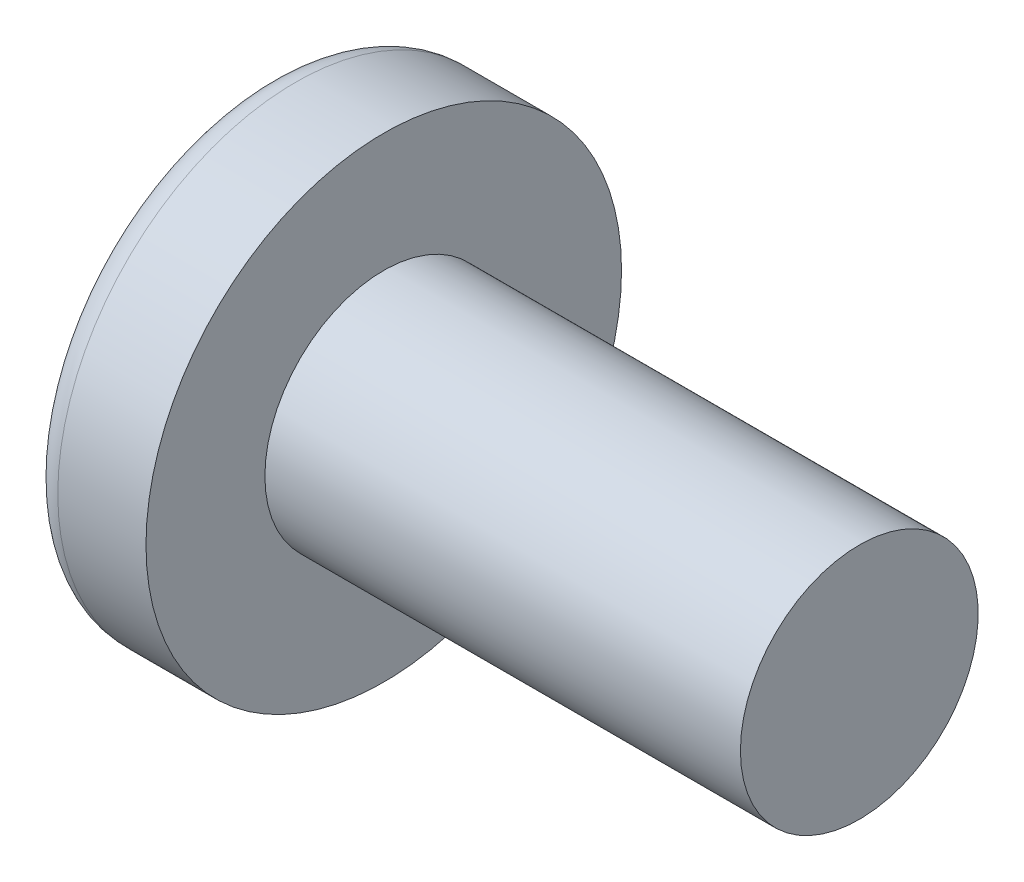
ISO-10303-21;
HEADER;
FILE_DESCRIPTION(('STEP AP214'),'2;1');
FILE_NAME('part.step','',(''),(''),'','','');
FILE_SCHEMA(('AUTOMOTIVE_DESIGN { 1 0 10303 214 1 1 1 1 }'));
ENDSEC;
DATA;
#1=APPLICATION_CONTEXT('core data for automotive mechanical design processes');
#2=APPLICATION_PROTOCOL_DEFINITION('international standard','automotive_design',2000,#1);
#3=PRODUCT_CONTEXT('',#1,'mechanical');
#4=PRODUCT('Part','Part','',(#3));
#5=PRODUCT_RELATED_PRODUCT_CATEGORY('part','',(#4));
#6=PRODUCT_DEFINITION_FORMATION('','',#4);
#7=PRODUCT_DEFINITION_CONTEXT('part definition',#1,'design');
#8=PRODUCT_DEFINITION('design','',#6,#7);
#9=PRODUCT_DEFINITION_SHAPE('','',#8);
#10=(LENGTH_UNIT() NAMED_UNIT(*) SI_UNIT(.MILLI.,.METRE.));
#11=(NAMED_UNIT(*) PLANE_ANGLE_UNIT() SI_UNIT($,.RADIAN.));
#12=(NAMED_UNIT(*) SI_UNIT($,.STERADIAN.) SOLID_ANGLE_UNIT());
#13=UNCERTAINTY_MEASURE_WITH_UNIT(LENGTH_MEASURE(1.E-05),#10,'distance_accuracy_value','');
#14=(GEOMETRIC_REPRESENTATION_CONTEXT(3) GLOBAL_UNCERTAINTY_ASSIGNED_CONTEXT((#13)) GLOBAL_UNIT_ASSIGNED_CONTEXT((#10,
#11,#12)) REPRESENTATION_CONTEXT('',''));
#15=CARTESIAN_POINT('',(0.,0.,0.));
#16=DIRECTION('',(0.,0.,1.));
#17=DIRECTION('',(1.,0.,0.));
#18=AXIS2_PLACEMENT_3D('',#15,#16,#17);
#19=CARTESIAN_POINT('',(6.5,0.,0.));
#20=DIRECTION('',(-1.,0.,0.));
#21=DIRECTION('',(0.,1.,0.));
#22=AXIS2_PLACEMENT_3D('',#19,#20,#21);
#23=SPHERICAL_SURFACE('',#22,6.5);
#24=CARTESIAN_POINT('',(1.22696010591455,0.,0.));
#25=DIRECTION('',(-1.,0.,0.));
#26=DIRECTION('',(0.,0.,1.));
#27=AXIS2_PLACEMENT_3D('',#24,#25,#26);
#28=CIRCLE('',#27,3.80066445182724);
#29=CARTESIAN_POINT('',(1.22696010591455,0.,3.80066445182724));
#30=VERTEX_POINT('',#29);
#31=EDGE_CURVE('E155',#30,#30,#28,.T.);
#32=ORIENTED_EDGE('',*,*,#31,.T.);
#33=EDGE_LOOP('',(#32));
#34=FACE_BOUND('',#33,.T.);
#35=CARTESIAN_POINT('',(6.48571960757402,-0.15048155459631,0.));
#36=DIRECTION('',(-0.0944735162161081,-0.995527375180494,0.));
#37=DIRECTION('',(0.995527375180494,-0.0944735162161081,0.));
#38=AXIS2_PLACEMENT_3D('',#35,#36,#37);
#39=CIRCLE('',#38,6.49824217555167);
#40=CARTESIAN_POINT('',(0.314004666074211,0.4352015980154,1.94783502836694));
#41=VERTEX_POINT('',#40);
#42=CARTESIAN_POINT('',(0.0329034112486436,0.461877533422321,0.461877533422323));
#43=VERTEX_POINT('',#42);
#44=EDGE_CURVE('E186',#41,#43,#39,.T.);
#45=ORIENTED_EDGE('',*,*,#44,.F.);
#46=CARTESIAN_POINT('',(5.02565375064329,0.,-1.83590765485334));
#47=DIRECTION('',(0.626149356629992,0.,0.779703137861998));
#48=DIRECTION('',(0.779703137861998,0.,-0.626149356629992));
#49=AXIS2_PLACEMENT_3D('',#46,#47,#48);
#50=CIRCLE('',#49,6.05852673674539);
#51=CARTESIAN_POINT('',(0.314004666074211,-0.435201598015413,1.94783502836693));
#52=VERTEX_POINT('',#51);
#53=EDGE_CURVE('E151',#41,#52,#50,.T.);
#54=ORIENTED_EDGE('',*,*,#53,.T.);
#55=CARTESIAN_POINT('',(6.48571960757402,0.15048155459631,0.));
#56=DIRECTION('',(-0.0944735162161081,0.995527375180494,0.));
#57=DIRECTION('',(-0.995527375180494,-0.0944735162161081,0.));
#58=AXIS2_PLACEMENT_3D('',#55,#56,#57);
#59=CIRCLE('',#58,6.49824217555167);
#60=CARTESIAN_POINT('',(0.0329034112486436,-0.461877533422324,0.461877533422323));
#61=VERTEX_POINT('',#60);
#62=EDGE_CURVE('E107',#61,#52,#59,.T.);
#63=ORIENTED_EDGE('',*,*,#62,.F.);
#64=CARTESIAN_POINT('',(6.48571960757402,0.,-0.15048155459631));
#65=DIRECTION('',(-0.0944735162161081,0.,-0.995527375180494));
#66=DIRECTION('',(-0.995527375180494,0.,0.0944735162161081));
#67=AXIS2_PLACEMENT_3D('',#64,#65,#66);
#68=CIRCLE('',#67,6.49824217555167);
#69=CARTESIAN_POINT('',(0.31400466607421,-1.94783502836693,0.435201598015406));
#70=VERTEX_POINT('',#69);
#71=EDGE_CURVE('E132',#70,#61,#68,.T.);
#72=ORIENTED_EDGE('',*,*,#71,.F.);
#73=CARTESIAN_POINT('',(5.02565375064329,1.83590765485334,0.));
#74=DIRECTION('',(0.626149356629992,-0.779703137861998,0.));
#75=DIRECTION('',(0.779703137861998,0.626149356629992,0.));
#76=AXIS2_PLACEMENT_3D('',#73,#74,#75);
#77=CIRCLE('',#76,6.05852673674539);
#78=CARTESIAN_POINT('',(0.31400466607421,-1.94783502836693,-0.435201598015407));
#79=VERTEX_POINT('',#78);
#80=EDGE_CURVE('E140',#70,#79,#77,.T.);
#81=ORIENTED_EDGE('',*,*,#80,.T.);
#82=CARTESIAN_POINT('',(6.48571960757402,0.,0.15048155459631));
#83=DIRECTION('',(-0.0944735162161081,0.,0.995527375180494));
#84=DIRECTION('',(0.995527375180494,0.,0.0944735162161081));
#85=AXIS2_PLACEMENT_3D('',#82,#83,#84);
#86=CIRCLE('',#85,6.49824217555167);
#87=CARTESIAN_POINT('',(0.0329034112486436,-0.461877533422321,-0.461877533422323));
#88=VERTEX_POINT('',#87);
#89=EDGE_CURVE('E50',#88,#79,#86,.T.);
#90=ORIENTED_EDGE('',*,*,#89,.F.);
#91=CARTESIAN_POINT('',(0.314004666074211,-0.435201598015399,-1.94783502836694));
#92=VERTEX_POINT('',#91);
#93=EDGE_CURVE('E193',#92,#88,#59,.T.);
#94=ORIENTED_EDGE('',*,*,#93,.F.);
#95=CARTESIAN_POINT('',(5.02565375064329,0.,1.83590765485334));
#96=DIRECTION('',(0.626149356629992,0.,-0.779703137861998));
#97=DIRECTION('',(-0.779703137861998,0.,-0.626149356629992));
#98=AXIS2_PLACEMENT_3D('',#95,#96,#97);
#99=CIRCLE('',#98,6.05852673674539);
#100=CARTESIAN_POINT('',(0.314004666074212,0.435201598015413,-1.94783502836693));
#101=VERTEX_POINT('',#100);
#102=EDGE_CURVE('E133',#92,#101,#99,.T.);
#103=ORIENTED_EDGE('',*,*,#102,.T.);
#104=CARTESIAN_POINT('',(0.0329034112486436,0.461877533422324,-0.461877533422323));
#105=VERTEX_POINT('',#104);
#106=EDGE_CURVE('E181',#105,#101,#39,.T.);
#107=ORIENTED_EDGE('',*,*,#106,.F.);
#108=CARTESIAN_POINT('',(0.314004666074212,1.94783502836693,-0.435201598015406));
#109=VERTEX_POINT('',#108);
#110=EDGE_CURVE('E43',#109,#105,#86,.T.);
#111=ORIENTED_EDGE('',*,*,#110,.F.);
#112=CARTESIAN_POINT('',(5.02565375064329,-1.83590765485334,0.));
#113=DIRECTION('',(0.626149356629992,0.779703137861998,0.));
#114=DIRECTION('',(-0.779703137861998,0.626149356629992,0.));
#115=AXIS2_PLACEMENT_3D('',#112,#113,#114);
#116=CIRCLE('',#115,6.05852673674539);
#117=CARTESIAN_POINT('',(0.314004666074212,1.94783502836693,0.435201598015407));
#118=VERTEX_POINT('',#117);
#119=EDGE_CURVE('E11',#109,#118,#116,.T.);
#120=ORIENTED_EDGE('',*,*,#119,.T.);
#121=EDGE_CURVE('E169',#43,#118,#68,.T.);
#122=ORIENTED_EDGE('',*,*,#121,.F.);
#123=EDGE_LOOP('',(#45,#54,#63,#72,#81,#90,#94,#103,#107,#111,#120,#122));
#124=FACE_BOUND('',#123,.T.);
#125=ADVANCED_FACE('F35',(#34,#124),#23,.T.);
#126=CARTESIAN_POINT('',(2.73951715374841,0.,-0.20502541296061));
#127=DIRECTION('',(-0.0944735162161081,0.,0.995527375180494));
#128=DIRECTION('',(0.995527375180494,0.,0.0944735162161081));
#129=AXIS2_PLACEMENT_3D('',#126,#127,#128);
#130=PLANE('',#129);
#131=ORIENTED_EDGE('',*,*,#110,.T.);
#132=DIRECTION('',(0.991114231601325,-0.0940547178968607,0.0940547178968604));
#133=VECTOR('',#132,1.);
#134=CARTESIAN_POINT('',(2.75862941145706,0.203211698708667,-0.203211698708667));
#135=LINE('',#134,#133);
#136=CARTESIAN_POINT('',(2.45,0.232500000000001,-0.232499999999999));
#137=VERTEX_POINT('',#136);
#138=EDGE_CURVE('E175',#105,#137,#135,.T.);
#139=ORIENTED_EDGE('',*,*,#138,.T.);
#140=DIRECTION('',(0.777577482844895,-0.624442325509115,0.0737905162291584));
#141=VECTOR('',#140,1.);
#142=CARTESIAN_POINT('',(0.,2.2,-0.465));
#143=LINE('',#142,#141);
#144=EDGE_CURVE('E156',#109,#137,#143,.T.);
#145=ORIENTED_EDGE('',*,*,#144,.F.);
#146=EDGE_LOOP('',(#131,#139,#145));
#147=FACE_BOUND('',#146,.T.);
#148=ADVANCED_FACE('F174',(#147),#130,.T.);
#149=DIRECTION('',(0.777577482844895,0.624442325509115,0.0737905162291584));
#150=VECTOR('',#149,1.);
#151=CARTESIAN_POINT('',(0.,-2.2,-0.465));
#152=LINE('',#151,#150);
#153=CARTESIAN_POINT('',(2.45,-0.2325,-0.2325));
#154=VERTEX_POINT('',#153);
#155=EDGE_CURVE('E141',#79,#154,#152,.T.);
#156=ORIENTED_EDGE('',*,*,#155,.T.);
#157=DIRECTION('',(-0.991114231601325,-0.09405471789686,-0.0940547178968604));
#158=VECTOR('',#157,1.);
#159=CARTESIAN_POINT('',(2.75862941145706,-0.203211698708666,-0.203211698708667));
#160=LINE('',#159,#158);
#161=EDGE_CURVE('E196',#154,#88,#160,.T.);
#162=ORIENTED_EDGE('',*,*,#161,.T.);
#163=ORIENTED_EDGE('',*,*,#89,.T.);
#164=EDGE_LOOP('',(#156,#162,#163));
#165=FACE_BOUND('',#164,.T.);
#166=ADVANCED_FACE('F211',(#165),#130,.T.);
#167=CARTESIAN_POINT('',(2.73951715374841,0.,0.20502541296061));
#168=DIRECTION('',(-0.0944735162161081,0.,-0.995527375180494));
#169=DIRECTION('',(-0.995527375180494,0.,0.0944735162161081));
#170=AXIS2_PLACEMENT_3D('',#167,#168,#169);
#171=PLANE('',#170);
#172=DIRECTION('',(0.777577482844895,-0.624442325509115,-0.0737905162291585));
#173=VECTOR('',#172,1.);
#174=CARTESIAN_POINT('',(0.,2.2,0.465));
#175=LINE('',#174,#173);
#176=CARTESIAN_POINT('',(2.45,0.2325,0.2325));
#177=VERTEX_POINT('',#176);
#178=EDGE_CURVE('E212',#118,#177,#175,.T.);
#179=ORIENTED_EDGE('',*,*,#178,.T.);
#180=DIRECTION('',(-0.991114231601325,0.0940547178968601,0.0940547178968604));
#181=VECTOR('',#180,1.);
#182=CARTESIAN_POINT('',(2.75862941145706,0.203211698708666,0.203211698708667));
#183=LINE('',#182,#181);
#184=EDGE_CURVE('E190',#177,#43,#183,.T.);
#185=ORIENTED_EDGE('',*,*,#184,.T.);
#186=ORIENTED_EDGE('',*,*,#121,.T.);
#187=EDGE_LOOP('',(#179,#185,#186));
#188=FACE_BOUND('',#187,.T.);
#189=ADVANCED_FACE('F216',(#188),#171,.T.);
#190=ORIENTED_EDGE('',*,*,#71,.T.);
#191=DIRECTION('',(0.991114231601325,0.0940547178968607,-0.0940547178968603));
#192=VECTOR('',#191,1.);
#193=CARTESIAN_POINT('',(2.75862941145706,-0.203211698708668,0.203211698708667));
#194=LINE('',#193,#192);
#195=CARTESIAN_POINT('',(2.45,-0.232500000000001,0.232499999999999));
#196=VERTEX_POINT('',#195);
#197=EDGE_CURVE('E105',#61,#196,#194,.T.);
#198=ORIENTED_EDGE('',*,*,#197,.T.);
#199=DIRECTION('',(0.777577482844895,0.624442325509115,-0.0737905162291583));
#200=VECTOR('',#199,1.);
#201=CARTESIAN_POINT('',(0.,-2.2,0.465));
#202=LINE('',#201,#200);
#203=EDGE_CURVE('E130',#70,#196,#202,.T.);
#204=ORIENTED_EDGE('',*,*,#203,.F.);
#205=EDGE_LOOP('',(#190,#198,#204));
#206=FACE_BOUND('',#205,.T.);
#207=ADVANCED_FACE('F129',(#206),#171,.T.);
#208=CARTESIAN_POINT('',(-25.4,0.,0.));
#209=DIRECTION('',(-1.,0.,0.));
#210=DIRECTION('',(0.,0.,1.));
#211=AXIS2_PLACEMENT_3D('',#208,#209,#210);
#212=CYLINDRICAL_SURFACE('',#211,2.);
#213=CARTESIAN_POINT('',(11.1,0.,0.));
#214=DIRECTION('',(-1.,0.,0.));
#215=DIRECTION('',(0.,0.,1.));
#216=AXIS2_PLACEMENT_3D('',#213,#214,#215);
#217=CIRCLE('',#216,2.);
#218=CARTESIAN_POINT('',(11.1,0.,2.));
#219=VERTEX_POINT('',#218);
#220=EDGE_CURVE('E152',#219,#219,#217,.T.);
#221=ORIENTED_EDGE('',*,*,#220,.T.);
#222=EDGE_LOOP('',(#221));
#223=FACE_BOUND('',#222,.T.);
#224=CARTESIAN_POINT('',(3.1,0.,0.));
#225=DIRECTION('',(-1.,0.,0.));
#226=DIRECTION('',(0.,0.,1.));
#227=AXIS2_PLACEMENT_3D('',#224,#225,#226);
#228=CIRCLE('',#227,2.);
#229=CARTESIAN_POINT('',(3.1,0.,2.));
#230=VERTEX_POINT('',#229);
#231=EDGE_CURVE('E165',#230,#230,#228,.T.);
#232=ORIENTED_EDGE('',*,*,#231,.F.);
#233=EDGE_LOOP('',(#232));
#234=FACE_BOUND('',#233,.T.);
#235=ADVANCED_FACE('F37',(#223,#234),#212,.T.);
#236=CARTESIAN_POINT('',(3.1,2.,0.));
#237=DIRECTION('',(-1.,0.,0.));
#238=DIRECTION('',(0.,0.,1.));
#239=AXIS2_PLACEMENT_3D('',#236,#237,#238);
#240=PLANE('',#239);
#241=CARTESIAN_POINT('',(3.1,0.,0.));
#242=DIRECTION('',(-1.,0.,0.));
#243=DIRECTION('',(0.,0.,1.));
#244=AXIS2_PLACEMENT_3D('',#241,#242,#243);
#245=CIRCLE('',#244,4.);
#246=CARTESIAN_POINT('',(3.1,0.,4.));
#247=VERTEX_POINT('',#246);
#248=EDGE_CURVE('E162',#247,#247,#245,.T.);
#249=ORIENTED_EDGE('',*,*,#248,.F.);
#250=EDGE_LOOP('',(#249));
#251=FACE_BOUND('',#250,.T.);
#252=ORIENTED_EDGE('',*,*,#231,.T.);
#253=EDGE_LOOP('',(#252));
#254=FACE_BOUND('',#253,.T.);
#255=ADVANCED_FACE('F244',(#251,#254),#240,.F.);
#256=CARTESIAN_POINT('',(-25.4,0.,0.));
#257=DIRECTION('',(-1.,0.,0.));
#258=DIRECTION('',(0.,0.,1.));
#259=AXIS2_PLACEMENT_3D('',#256,#257,#258);
#260=CYLINDRICAL_SURFACE('',#259,4.);
#261=ORIENTED_EDGE('',*,*,#248,.T.);
#262=EDGE_LOOP('',(#261));
#263=FACE_BOUND('',#262,.T.);
#264=CARTESIAN_POINT('',(1.61635382117009,0.,0.));
#265=DIRECTION('',(-1.,0.,0.));
#266=DIRECTION('',(0.,0.,1.));
#267=AXIS2_PLACEMENT_3D('',#264,#265,#266);
#268=CIRCLE('',#267,4.);
#269=CARTESIAN_POINT('',(1.61635382117009,0.,4.));
#270=VERTEX_POINT('',#269);
#271=EDGE_CURVE('E159',#270,#270,#268,.T.);
#272=ORIENTED_EDGE('',*,*,#271,.F.);
#273=EDGE_LOOP('',(#272));
#274=FACE_BOUND('',#273,.T.);
#275=ADVANCED_FACE('F241',(#263,#274),#260,.T.);
#276=CARTESIAN_POINT('',(1.61635382117009,0.,0.));
#277=DIRECTION('',(-1.,0.,0.));
#278=DIRECTION('',(0.,0.,1.));
#279=AXIS2_PLACEMENT_3D('',#276,#277,#278);
#280=TOROIDAL_SURFACE('',#279,3.52,0.48);
#281=ORIENTED_EDGE('',*,*,#271,.T.);
#282=EDGE_LOOP('',(#281));
#283=FACE_BOUND('',#282,.T.);
#284=ORIENTED_EDGE('',*,*,#31,.F.);
#285=EDGE_LOOP('',(#284));
#286=FACE_BOUND('',#285,.T.);
#287=ADVANCED_FACE('F238',(#283,#286),#280,.T.);
#288=CARTESIAN_POINT('',(11.1,2.,0.));
#289=DIRECTION('',(1.,0.,0.));
#290=DIRECTION('',(0.,0.,-1.));
#291=AXIS2_PLACEMENT_3D('',#288,#289,#290);
#292=PLANE('',#291);
#293=ORIENTED_EDGE('',*,*,#220,.F.);
#294=EDGE_LOOP('',(#293));
#295=FACE_BOUND('',#294,.T.);
#296=ADVANCED_FACE('F236',(#295),#292,.T.);
#297=CARTESIAN_POINT('',(2.45,0.2325,0.2325));
#298=DIRECTION('',(0.626149356629992,0.779703137861998,0.));
#299=DIRECTION('',(-0.779703137861998,0.626149356629992,0.));
#300=AXIS2_PLACEMENT_3D('',#297,#298,#299);
#301=PLANE('',#300);
#302=ORIENTED_EDGE('',*,*,#144,.T.);
#303=DIRECTION('',(0.,0.,-1.));
#304=VECTOR('',#303,1.);
#305=CARTESIAN_POINT('',(2.45,0.2325,0.2325));
#306=LINE('',#305,#304);
#307=EDGE_CURVE('E123',#177,#137,#306,.T.);
#308=ORIENTED_EDGE('',*,*,#307,.F.);
#309=ORIENTED_EDGE('',*,*,#178,.F.);
#310=ORIENTED_EDGE('',*,*,#119,.F.);
#311=EDGE_LOOP('',(#302,#308,#309,#310));
#312=FACE_BOUND('',#311,.T.);
#313=ADVANCED_FACE('F215',(#312),#301,.F.);
#314=CARTESIAN_POINT('',(2.45,-0.2325,-0.2325));
#315=DIRECTION('',(0.626149356629992,-0.779703137861998,0.));
#316=DIRECTION('',(0.779703137861998,0.626149356629992,0.));
#317=AXIS2_PLACEMENT_3D('',#314,#315,#316);
#318=PLANE('',#317);
#319=ORIENTED_EDGE('',*,*,#203,.T.);
#320=DIRECTION('',(0.,0.,1.));
#321=VECTOR('',#320,1.);
#322=CARTESIAN_POINT('',(2.45,-0.2325,-0.2325));
#323=LINE('',#322,#321);
#324=EDGE_CURVE('E122',#154,#196,#323,.T.);
#325=ORIENTED_EDGE('',*,*,#324,.F.);
#326=ORIENTED_EDGE('',*,*,#155,.F.);
#327=ORIENTED_EDGE('',*,*,#80,.F.);
#328=EDGE_LOOP('',(#319,#325,#326,#327));
#329=FACE_BOUND('',#328,.T.);
#330=ADVANCED_FACE('F137',(#329),#318,.F.);
#331=CARTESIAN_POINT('',(2.45,0.2325,-0.2325));
#332=DIRECTION('',(-1.,0.,0.));
#333=DIRECTION('',(0.,0.,1.));
#334=AXIS2_PLACEMENT_3D('',#331,#332,#333);
#335=PLANE('',#334);
#336=DIRECTION('',(0.,1.,0.));
#337=VECTOR('',#336,1.);
#338=CARTESIAN_POINT('',(2.45,-0.2325,-0.2325));
#339=LINE('',#338,#337);
#340=EDGE_CURVE('E145',#154,#137,#339,.T.);
#341=ORIENTED_EDGE('',*,*,#340,.F.);
#342=ORIENTED_EDGE('',*,*,#324,.T.);
#343=DIRECTION('',(0.,-1.,0.));
#344=VECTOR('',#343,1.);
#345=CARTESIAN_POINT('',(2.45,0.2325,0.2325));
#346=LINE('',#345,#344);
#347=EDGE_CURVE('E114',#177,#196,#346,.T.);
#348=ORIENTED_EDGE('',*,*,#347,.F.);
#349=ORIENTED_EDGE('',*,*,#307,.T.);
#350=EDGE_LOOP('',(#341,#342,#348,#349));
#351=FACE_BOUND('',#350,.T.);
#352=ADVANCED_FACE('F143',(#351),#335,.T.);
#353=CARTESIAN_POINT('',(2.45,0.232500000000001,-0.232499999999999));
#354=DIRECTION('',(0.626149356629992,0.,-0.779703137861998));
#355=DIRECTION('',(0.779703137861998,0.,0.626149356629992));
#356=AXIS2_PLACEMENT_3D('',#353,#354,#355);
#357=PLANE('',#356);
#358=DIRECTION('',(0.777577482844895,0.0737905162291561,0.624442325509115));
#359=VECTOR('',#358,1.);
#360=CARTESIAN_POINT('',(0.,-0.464999999999992,-2.2));
#361=LINE('',#360,#359);
#362=EDGE_CURVE('E201',#92,#154,#361,.T.);
#363=ORIENTED_EDGE('',*,*,#362,.T.);
#364=ORIENTED_EDGE('',*,*,#340,.T.);
#365=DIRECTION('',(0.777577482844895,-0.0737905162291606,0.624442325509114));
#366=VECTOR('',#365,1.);
#367=CARTESIAN_POINT('',(0.,0.465000000000008,-2.2));
#368=LINE('',#367,#366);
#369=EDGE_CURVE('E111',#101,#137,#368,.T.);
#370=ORIENTED_EDGE('',*,*,#369,.F.);
#371=ORIENTED_EDGE('',*,*,#102,.F.);
#372=EDGE_LOOP('',(#363,#364,#370,#371));
#373=FACE_BOUND('',#372,.T.);
#374=ADVANCED_FACE('F206',(#373),#357,.F.);
#375=CARTESIAN_POINT('',(2.73951715374841,-0.20502541296061,0.));
#376=DIRECTION('',(-0.0944735162161081,0.995527375180494,0.));
#377=DIRECTION('',(-0.995527375180494,-0.0944735162161081,0.));
#378=AXIS2_PLACEMENT_3D('',#375,#376,#377);
#379=PLANE('',#378);
#380=ORIENTED_EDGE('',*,*,#93,.T.);
#381=ORIENTED_EDGE('',*,*,#161,.F.);
#382=ORIENTED_EDGE('',*,*,#362,.F.);
#383=EDGE_LOOP('',(#380,#381,#382));
#384=FACE_BOUND('',#383,.T.);
#385=ADVANCED_FACE('F210',(#384),#379,.T.);
#386=CARTESIAN_POINT('',(2.73951715374841,0.20502541296061,0.));
#387=DIRECTION('',(-0.0944735162161081,-0.995527375180494,0.));
#388=DIRECTION('',(0.995527375180494,-0.0944735162161081,0.));
#389=AXIS2_PLACEMENT_3D('',#386,#387,#388);
#390=PLANE('',#389);
#391=ORIENTED_EDGE('',*,*,#106,.T.);
#392=ORIENTED_EDGE('',*,*,#369,.T.);
#393=ORIENTED_EDGE('',*,*,#138,.F.);
#394=EDGE_LOOP('',(#391,#392,#393));
#395=FACE_BOUND('',#394,.T.);
#396=ADVANCED_FACE('F204',(#395),#390,.T.);
#397=CARTESIAN_POINT('',(2.45,-0.232500000000001,0.232499999999999));
#398=DIRECTION('',(0.626149356629992,0.,0.779703137861998));
#399=DIRECTION('',(-0.779703137861998,0.,0.626149356629992));
#400=AXIS2_PLACEMENT_3D('',#397,#398,#399);
#401=PLANE('',#400);
#402=DIRECTION('',(0.777577482844895,-0.0737905162291562,-0.624442325509115));
#403=VECTOR('',#402,1.);
#404=CARTESIAN_POINT('',(0.,0.464999999999992,2.2));
#405=LINE('',#404,#403);
#406=EDGE_CURVE('E110',#41,#177,#405,.T.);
#407=ORIENTED_EDGE('',*,*,#406,.T.);
#408=ORIENTED_EDGE('',*,*,#347,.T.);
#409=DIRECTION('',(0.777577482844895,0.0737905162291606,-0.624442325509114));
#410=VECTOR('',#409,1.);
#411=CARTESIAN_POINT('',(0.,-0.465000000000008,2.2));
#412=LINE('',#411,#410);
#413=EDGE_CURVE('E101',#52,#196,#412,.T.);
#414=ORIENTED_EDGE('',*,*,#413,.F.);
#415=ORIENTED_EDGE('',*,*,#53,.F.);
#416=EDGE_LOOP('',(#407,#408,#414,#415));
#417=FACE_BOUND('',#416,.T.);
#418=ADVANCED_FACE('F115',(#417),#401,.F.);
#419=ORIENTED_EDGE('',*,*,#44,.T.);
#420=ORIENTED_EDGE('',*,*,#184,.F.);
#421=ORIENTED_EDGE('',*,*,#406,.F.);
#422=EDGE_LOOP('',(#419,#420,#421));
#423=FACE_BOUND('',#422,.T.);
#424=ADVANCED_FACE('F217',(#423),#390,.T.);
#425=ORIENTED_EDGE('',*,*,#62,.T.);
#426=ORIENTED_EDGE('',*,*,#413,.T.);
#427=ORIENTED_EDGE('',*,*,#197,.F.);
#428=EDGE_LOOP('',(#425,#426,#427));
#429=FACE_BOUND('',#428,.T.);
#430=ADVANCED_FACE('F103',(#429),#379,.T.);
#431=CLOSED_SHELL('',(#125,#148,#166,#189,#207,#235,#255,#275,#287,#296,#313,#330,#352,#374,
#385,#396,#418,#424,#430));
#432=MANIFOLD_SOLID_BREP('B2',#431);
#433=ADVANCED_BREP_SHAPE_REPRESENTATION('',(#18,#432),#14);
#434=SHAPE_DEFINITION_REPRESENTATION(#9,#433);
ENDSEC;
END-ISO-10303-21;
